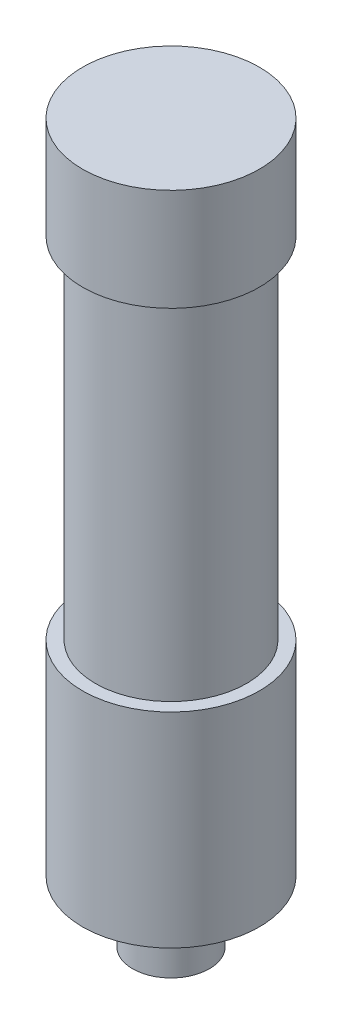
ISO-10303-21;
HEADER;
FILE_DESCRIPTION(('STEP AP214'),'2;1');
FILE_NAME('part.step','',(''),(''),'','','');
FILE_SCHEMA(('AUTOMOTIVE_DESIGN { 1 0 10303 214 1 1 1 1 }'));
ENDSEC;
DATA;
#1=APPLICATION_CONTEXT('core data for automotive mechanical design processes');
#2=APPLICATION_PROTOCOL_DEFINITION('international standard','automotive_design',2000,#1);
#3=PRODUCT_CONTEXT('',#1,'mechanical');
#4=PRODUCT('Part','Part','',(#3));
#5=PRODUCT_RELATED_PRODUCT_CATEGORY('part','',(#4));
#6=PRODUCT_DEFINITION_FORMATION('','',#4);
#7=PRODUCT_DEFINITION_CONTEXT('part definition',#1,'design');
#8=PRODUCT_DEFINITION('design','',#6,#7);
#9=PRODUCT_DEFINITION_SHAPE('','',#8);
#10=(LENGTH_UNIT() NAMED_UNIT(*) SI_UNIT(.MILLI.,.METRE.));
#11=(NAMED_UNIT(*) PLANE_ANGLE_UNIT() SI_UNIT($,.RADIAN.));
#12=(NAMED_UNIT(*) SI_UNIT($,.STERADIAN.) SOLID_ANGLE_UNIT());
#13=UNCERTAINTY_MEASURE_WITH_UNIT(LENGTH_MEASURE(1.E-05),#10,'distance_accuracy_value','');
#14=(GEOMETRIC_REPRESENTATION_CONTEXT(3) GLOBAL_UNCERTAINTY_ASSIGNED_CONTEXT((#13)) GLOBAL_UNIT_ASSIGNED_CONTEXT((#10,
#11,#12)) REPRESENTATION_CONTEXT('',''));
#15=CARTESIAN_POINT('',(0.,0.,0.));
#16=DIRECTION('',(0.,0.,1.));
#17=DIRECTION('',(1.,0.,0.));
#18=AXIS2_PLACEMENT_3D('',#15,#16,#17);
#19=CARTESIAN_POINT('',(0.,25.4,0.));
#20=DIRECTION('',(0.,1.,0.));
#21=DIRECTION('',(0.,0.,1.));
#22=AXIS2_PLACEMENT_3D('',#19,#20,#21);
#23=PLANE('',#22);
#24=CARTESIAN_POINT('',(0.,25.4,0.));
#25=DIRECTION('',(0.,1.,0.));
#26=DIRECTION('',(0.,0.,1.));
#27=AXIS2_PLACEMENT_3D('',#24,#25,#26);
#28=CIRCLE('',#27,10.9855);
#29=CARTESIAN_POINT('',(0.,25.4,10.9855));
#30=VERTEX_POINT('',#29);
#31=EDGE_CURVE('E10',#30,#30,#28,.T.);
#32=ORIENTED_EDGE('',*,*,#31,.T.);
#33=EDGE_LOOP('',(#32));
#34=FACE_BOUND('',#33,.T.);
#35=ADVANCED_FACE('F37',(#34),#23,.T.);
#36=CARTESIAN_POINT('',(0.,25.4,0.));
#37=DIRECTION('',(0.,1.,0.));
#38=DIRECTION('',(0.,0.,1.));
#39=AXIS2_PLACEMENT_3D('',#36,#37,#38);
#40=CYLINDRICAL_SURFACE('',#39,10.9855);
#41=CARTESIAN_POINT('',(0.,12.7,0.));
#42=DIRECTION('',(0.,1.,0.));
#43=DIRECTION('',(0.,0.,1.));
#44=AXIS2_PLACEMENT_3D('',#41,#42,#43);
#45=CIRCLE('',#44,10.9855);
#46=CARTESIAN_POINT('',(0.,12.7,10.9855));
#47=VERTEX_POINT('',#46);
#48=EDGE_CURVE('E44',#47,#47,#45,.T.);
#49=ORIENTED_EDGE('',*,*,#48,.T.);
#50=EDGE_LOOP('',(#49));
#51=FACE_BOUND('',#50,.T.);
#52=ORIENTED_EDGE('',*,*,#31,.F.);
#53=EDGE_LOOP('',(#52));
#54=FACE_BOUND('',#53,.T.);
#55=ADVANCED_FACE('F89',(#51,#54),#40,.T.);
#56=CARTESIAN_POINT('',(-10.9855,12.7,0.));
#57=DIRECTION('',(0.,-1.,0.));
#58=DIRECTION('',(0.,0.,-1.));
#59=AXIS2_PLACEMENT_3D('',#56,#57,#58);
#60=PLANE('',#59);
#61=CARTESIAN_POINT('',(0.,12.7,0.));
#62=DIRECTION('',(0.,1.,0.));
#63=DIRECTION('',(0.,0.,1.));
#64=AXIS2_PLACEMENT_3D('',#61,#62,#63);
#65=CIRCLE('',#64,9.398);
#66=CARTESIAN_POINT('',(0.,12.7,9.398));
#67=VERTEX_POINT('',#66);
#68=EDGE_CURVE('E49',#67,#67,#65,.T.);
#69=ORIENTED_EDGE('',*,*,#68,.T.);
#70=EDGE_LOOP('',(#69));
#71=FACE_BOUND('',#70,.T.);
#72=ORIENTED_EDGE('',*,*,#48,.F.);
#73=EDGE_LOOP('',(#72));
#74=FACE_BOUND('',#73,.T.);
#75=ADVANCED_FACE('F93',(#71,#74),#60,.T.);
#76=CARTESIAN_POINT('',(0.,25.4,0.));
#77=DIRECTION('',(0.,1.,0.));
#78=DIRECTION('',(0.,0.,1.));
#79=AXIS2_PLACEMENT_3D('',#76,#77,#78);
#80=CYLINDRICAL_SURFACE('',#79,9.398);
#81=CARTESIAN_POINT('',(0.,-30.734,0.));
#82=DIRECTION('',(0.,1.,0.));
#83=DIRECTION('',(0.,0.,1.));
#84=AXIS2_PLACEMENT_3D('',#81,#82,#83);
#85=CIRCLE('',#84,9.398);
#86=CARTESIAN_POINT('',(0.,-30.734,9.398));
#87=VERTEX_POINT('',#86);
#88=EDGE_CURVE('E54',#87,#87,#85,.T.);
#89=ORIENTED_EDGE('',*,*,#88,.T.);
#90=EDGE_LOOP('',(#89));
#91=FACE_BOUND('',#90,.T.);
#92=ORIENTED_EDGE('',*,*,#68,.F.);
#93=EDGE_LOOP('',(#92));
#94=FACE_BOUND('',#93,.T.);
#95=ADVANCED_FACE('F97',(#91,#94),#80,.T.);
#96=CARTESIAN_POINT('',(-9.398,-30.734,0.));
#97=DIRECTION('',(0.,1.,0.));
#98=DIRECTION('',(0.,0.,1.));
#99=AXIS2_PLACEMENT_3D('',#96,#97,#98);
#100=PLANE('',#99);
#101=CARTESIAN_POINT('',(0.,-30.734,0.));
#102=DIRECTION('',(0.,1.,0.));
#103=DIRECTION('',(0.,0.,1.));
#104=AXIS2_PLACEMENT_3D('',#101,#102,#103);
#105=CIRCLE('',#104,10.9855);
#106=CARTESIAN_POINT('',(0.,-30.734,10.9855));
#107=VERTEX_POINT('',#106);
#108=EDGE_CURVE('E60',#107,#107,#105,.T.);
#109=ORIENTED_EDGE('',*,*,#108,.T.);
#110=EDGE_LOOP('',(#109));
#111=FACE_BOUND('',#110,.T.);
#112=ORIENTED_EDGE('',*,*,#88,.F.);
#113=EDGE_LOOP('',(#112));
#114=FACE_BOUND('',#113,.T.);
#115=ADVANCED_FACE('F104',(#111,#114),#100,.T.);
#116=CARTESIAN_POINT('',(0.,25.4,0.));
#117=DIRECTION('',(0.,1.,0.));
#118=DIRECTION('',(0.,0.,1.));
#119=AXIS2_PLACEMENT_3D('',#116,#117,#118);
#120=CYLINDRICAL_SURFACE('',#119,10.9855);
#121=CARTESIAN_POINT('',(0.,-56.134,0.));
#122=DIRECTION('',(0.,1.,0.));
#123=DIRECTION('',(0.,0.,1.));
#124=AXIS2_PLACEMENT_3D('',#121,#122,#123);
#125=CIRCLE('',#124,10.9855);
#126=CARTESIAN_POINT('',(0.,-56.134,10.9855));
#127=VERTEX_POINT('',#126);
#128=EDGE_CURVE('E64',#127,#127,#125,.T.);
#129=ORIENTED_EDGE('',*,*,#128,.T.);
#130=EDGE_LOOP('',(#129));
#131=FACE_BOUND('',#130,.T.);
#132=ORIENTED_EDGE('',*,*,#108,.F.);
#133=EDGE_LOOP('',(#132));
#134=FACE_BOUND('',#133,.T.);
#135=ADVANCED_FACE('F108',(#131,#134),#120,.T.);
#136=CARTESIAN_POINT('',(-10.9855,-56.134,0.));
#137=DIRECTION('',(0.,-1.,0.));
#138=DIRECTION('',(0.,0.,-1.));
#139=AXIS2_PLACEMENT_3D('',#136,#137,#138);
#140=PLANE('',#139);
#141=CARTESIAN_POINT('',(0.,-56.134,0.));
#142=DIRECTION('',(0.,1.,0.));
#143=DIRECTION('',(0.,0.,1.));
#144=AXIS2_PLACEMENT_3D('',#141,#142,#143);
#145=CIRCLE('',#144,4.7625);
#146=CARTESIAN_POINT('',(0.,-56.134,4.7625));
#147=VERTEX_POINT('',#146);
#148=EDGE_CURVE('E68',#147,#147,#145,.T.);
#149=ORIENTED_EDGE('',*,*,#148,.T.);
#150=EDGE_LOOP('',(#149));
#151=FACE_BOUND('',#150,.T.);
#152=ORIENTED_EDGE('',*,*,#128,.F.);
#153=EDGE_LOOP('',(#152));
#154=FACE_BOUND('',#153,.T.);
#155=ADVANCED_FACE('F86',(#151,#154),#140,.T.);
#156=CARTESIAN_POINT('',(0.,25.4,0.));
#157=DIRECTION('',(0.,1.,0.));
#158=DIRECTION('',(0.,0.,1.));
#159=AXIS2_PLACEMENT_3D('',#156,#157,#158);
#160=CYLINDRICAL_SURFACE('',#159,4.7625);
#161=CARTESIAN_POINT('',(0.,-63.754,0.));
#162=DIRECTION('',(0.,1.,0.));
#163=DIRECTION('',(0.,0.,1.));
#164=AXIS2_PLACEMENT_3D('',#161,#162,#163);
#165=CIRCLE('',#164,4.7625);
#166=CARTESIAN_POINT('',(0.,-63.754,4.7625));
#167=VERTEX_POINT('',#166);
#168=EDGE_CURVE('E72',#167,#167,#165,.T.);
#169=ORIENTED_EDGE('',*,*,#168,.T.);
#170=EDGE_LOOP('',(#169));
#171=FACE_BOUND('',#170,.T.);
#172=ORIENTED_EDGE('',*,*,#148,.F.);
#173=EDGE_LOOP('',(#172));
#174=FACE_BOUND('',#173,.T.);
#175=ADVANCED_FACE('F77',(#171,#174),#160,.T.);
#176=CARTESIAN_POINT('',(-4.7625,-63.754,0.));
#177=DIRECTION('',(0.,-1.,0.));
#178=DIRECTION('',(0.,0.,-1.));
#179=AXIS2_PLACEMENT_3D('',#176,#177,#178);
#180=PLANE('',#179);
#181=ORIENTED_EDGE('',*,*,#168,.F.);
#182=EDGE_LOOP('',(#181));
#183=FACE_BOUND('',#182,.T.);
#184=ADVANCED_FACE('F80',(#183),#180,.T.);
#185=CLOSED_SHELL('',(#35,#55,#75,#95,#115,#135,#155,#175,#184));
#186=MANIFOLD_SOLID_BREP('B2',#185);
#187=ADVANCED_BREP_SHAPE_REPRESENTATION('',(#18,#186),#14);
#188=SHAPE_DEFINITION_REPRESENTATION(#9,#187);
ENDSEC;
END-ISO-10303-21;
